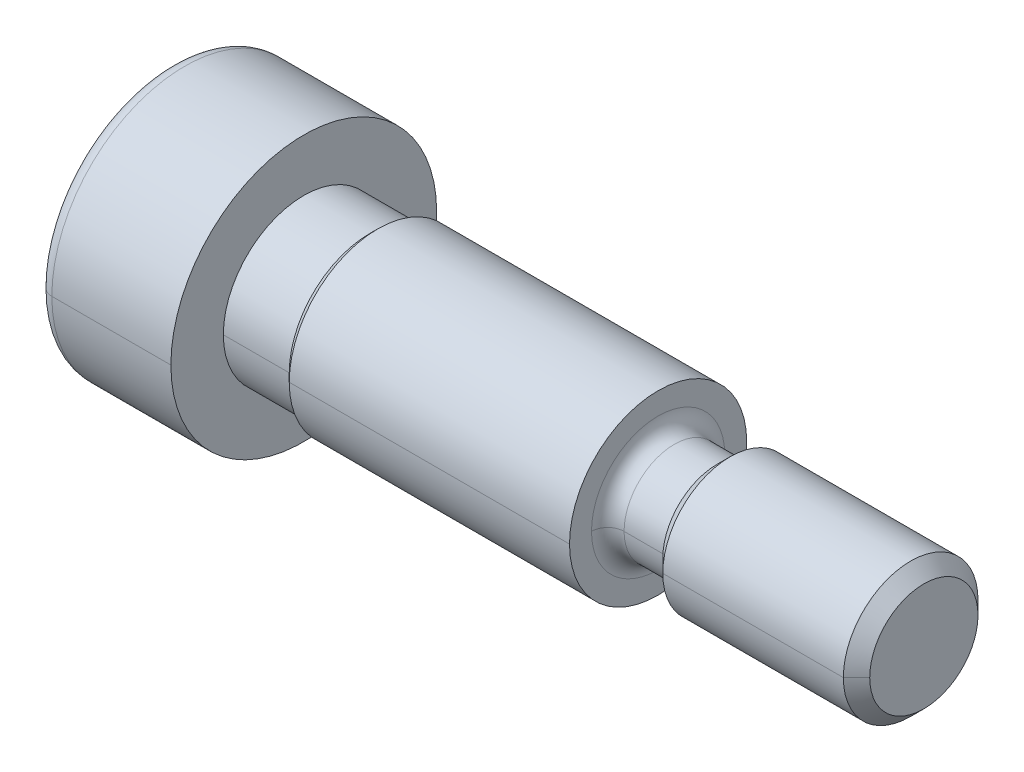
ISO-10303-21;
HEADER;
FILE_DESCRIPTION(('STEP AP214'),'2;1');
FILE_NAME('part.step','',(''),(''),'','','');
FILE_SCHEMA(('AUTOMOTIVE_DESIGN { 1 0 10303 214 1 1 1 1 }'));
ENDSEC;
DATA;
#1=APPLICATION_CONTEXT('core data for automotive mechanical design processes');
#2=APPLICATION_PROTOCOL_DEFINITION('international standard','automotive_design',2000,#1);
#3=PRODUCT_CONTEXT('',#1,'mechanical');
#4=PRODUCT('Part','Part','',(#3));
#5=PRODUCT_RELATED_PRODUCT_CATEGORY('part','',(#4));
#6=PRODUCT_DEFINITION_FORMATION('','',#4);
#7=PRODUCT_DEFINITION_CONTEXT('part definition',#1,'design');
#8=PRODUCT_DEFINITION('design','',#6,#7);
#9=PRODUCT_DEFINITION_SHAPE('','',#8);
#10=(LENGTH_UNIT() NAMED_UNIT(*) SI_UNIT(.MILLI.,.METRE.));
#11=(NAMED_UNIT(*) PLANE_ANGLE_UNIT() SI_UNIT($,.RADIAN.));
#12=(NAMED_UNIT(*) SI_UNIT($,.STERADIAN.) SOLID_ANGLE_UNIT());
#13=UNCERTAINTY_MEASURE_WITH_UNIT(LENGTH_MEASURE(1.E-05),#10,'distance_accuracy_value','');
#14=(GEOMETRIC_REPRESENTATION_CONTEXT(3) GLOBAL_UNCERTAINTY_ASSIGNED_CONTEXT((#13)) GLOBAL_UNIT_ASSIGNED_CONTEXT((#10,
#11,#12)) REPRESENTATION_CONTEXT('',''));
#15=CARTESIAN_POINT('',(0.,0.,0.));
#16=DIRECTION('',(0.,0.,1.));
#17=DIRECTION('',(1.,0.,0.));
#18=AXIS2_PLACEMENT_3D('',#15,#16,#17);
#19=CARTESIAN_POINT('',(-4.26719999746,0.,0.));
#20=DIRECTION('',(-1.,0.,0.));
#21=DIRECTION('',(0.,0.,1.));
#22=AXIS2_PLACEMENT_3D('',#19,#20,#21);
#23=TOROIDAL_SURFACE('',#22,4.25449999746,0.508);
#24=CARTESIAN_POINT('',(-4.26719999746,0.,4.25449999746));
#25=DIRECTION('',(0.,-1.,0.));
#26=DIRECTION('',(0.,0.,1.));
#27=AXIS2_PLACEMENT_3D('',#24,#25,#26);
#28=CIRCLE('',#27,0.508);
#29=CARTESIAN_POINT('',(-4.2672,0.,4.7625));
#30=VERTEX_POINT('',#29);
#31=CARTESIAN_POINT('',(-4.77519999746,0.,4.2545));
#32=VERTEX_POINT('',#31);
#33=EDGE_CURVE('E27',#30,#32,#28,.T.);
#34=ORIENTED_EDGE('',*,*,#33,.F.);
#35=CARTESIAN_POINT('',(-4.2672,0.,0.));
#36=DIRECTION('',(-1.,0.,0.));
#37=DIRECTION('',(0.,0.,1.));
#38=AXIS2_PLACEMENT_3D('',#35,#36,#37);
#39=CIRCLE('',#38,4.7625);
#40=CARTESIAN_POINT('',(-4.2672,0.,-4.7625));
#41=VERTEX_POINT('',#40);
#42=EDGE_CURVE('E189',#30,#41,#39,.T.);
#43=ORIENTED_EDGE('',*,*,#42,.T.);
#44=CARTESIAN_POINT('',(-4.26719999746,0.,-4.25449999746));
#45=DIRECTION('',(0.,-1.,0.));
#46=DIRECTION('',(0.,0.,-1.));
#47=AXIS2_PLACEMENT_3D('',#44,#45,#46);
#48=CIRCLE('',#47,0.508);
#49=CARTESIAN_POINT('',(-4.77519999746,0.,-4.2545));
#50=VERTEX_POINT('',#49);
#51=EDGE_CURVE('E10',#50,#41,#48,.T.);
#52=ORIENTED_EDGE('',*,*,#51,.F.);
#53=CARTESIAN_POINT('',(-4.77519999746,0.,0.));
#54=DIRECTION('',(-1.,0.,0.));
#55=DIRECTION('',(0.,0.,1.));
#56=AXIS2_PLACEMENT_3D('',#53,#54,#55);
#57=CIRCLE('',#56,4.2545);
#58=EDGE_CURVE('E283',#32,#50,#57,.T.);
#59=ORIENTED_EDGE('',*,*,#58,.F.);
#60=EDGE_LOOP('',(#34,#43,#52,#59));
#61=FACE_BOUND('',#60,.T.);
#62=ADVANCED_FACE('F16',(#61),#23,.T.);
#63=CARTESIAN_POINT('',(-4.26719999746,0.,0.));
#64=DIRECTION('',(-1.,0.,0.));
#65=DIRECTION('',(0.,0.,1.));
#66=AXIS2_PLACEMENT_3D('',#63,#64,#65);
#67=TOROIDAL_SURFACE('',#66,4.25449999746,0.508);
#68=ORIENTED_EDGE('',*,*,#33,.T.);
#69=CARTESIAN_POINT('',(-4.77519999746,0.,0.));
#70=DIRECTION('',(-1.,0.,0.));
#71=DIRECTION('',(0.,0.,1.));
#72=AXIS2_PLACEMENT_3D('',#69,#70,#71);
#73=CIRCLE('',#72,4.2545);
#74=EDGE_CURVE('E287',#50,#32,#73,.T.);
#75=ORIENTED_EDGE('',*,*,#74,.F.);
#76=ORIENTED_EDGE('',*,*,#51,.T.);
#77=CARTESIAN_POINT('',(-4.2672,0.,0.));
#78=DIRECTION('',(-1.,0.,0.));
#79=DIRECTION('',(0.,0.,1.));
#80=AXIS2_PLACEMENT_3D('',#77,#78,#79);
#81=CIRCLE('',#80,4.7625);
#82=EDGE_CURVE('E194',#41,#30,#81,.T.);
#83=ORIENTED_EDGE('',*,*,#82,.T.);
#84=EDGE_LOOP('',(#68,#75,#76,#83));
#85=FACE_BOUND('',#84,.T.);
#86=ADVANCED_FACE('F408',(#85),#67,.T.);
#87=CARTESIAN_POINT('',(-2.1336,0.,0.));
#88=DIRECTION('',(-1.,0.,0.));
#89=DIRECTION('',(0.,0.,1.));
#90=AXIS2_PLACEMENT_3D('',#87,#88,#89);
#91=CYLINDRICAL_SURFACE('',#90,4.7625);
#92=DIRECTION('',(-1.,0.,0.));
#93=VECTOR('',#92,1.);
#94=CARTESIAN_POINT('',(-2.1336,0.,4.7625));
#95=LINE('',#94,#93);
#96=CARTESIAN_POINT('',(0.,0.,4.7625));
#97=VERTEX_POINT('',#96);
#98=EDGE_CURVE('E184',#97,#30,#95,.T.);
#99=ORIENTED_EDGE('',*,*,#98,.F.);
#100=CARTESIAN_POINT('',(0.,0.,0.));
#101=DIRECTION('',(-1.,0.,0.));
#102=DIRECTION('',(0.,0.,1.));
#103=AXIS2_PLACEMENT_3D('',#100,#101,#102);
#104=CIRCLE('',#103,4.7625);
#105=CARTESIAN_POINT('',(0.,0.,-4.7625));
#106=VERTEX_POINT('',#105);
#107=EDGE_CURVE('E188',#97,#106,#104,.T.);
#108=ORIENTED_EDGE('',*,*,#107,.T.);
#109=DIRECTION('',(1.,0.,0.));
#110=VECTOR('',#109,1.);
#111=CARTESIAN_POINT('',(-2.1336,0.,-4.7625));
#112=LINE('',#111,#110);
#113=EDGE_CURVE('E20',#41,#106,#112,.T.);
#114=ORIENTED_EDGE('',*,*,#113,.F.);
#115=ORIENTED_EDGE('',*,*,#42,.F.);
#116=EDGE_LOOP('',(#99,#108,#114,#115));
#117=FACE_BOUND('',#116,.T.);
#118=ADVANCED_FACE('F18',(#117),#91,.T.);
#119=CARTESIAN_POINT('',(-4.77519999873,0.,2.12725));
#120=DIRECTION('',(-1.,0.,0.));
#121=DIRECTION('',(0.,0.,1.));
#122=AXIS2_PLACEMENT_3D('',#119,#120,#121);
#123=PLANE('',#122);
#124=ORIENTED_EDGE('',*,*,#58,.T.);
#125=ORIENTED_EDGE('',*,*,#74,.T.);
#126=EDGE_LOOP('',(#124,#125));
#127=FACE_BOUND('',#126,.T.);
#128=DIRECTION('',(0.,0.,-1.));
#129=VECTOR('',#128,1.);
#130=CARTESIAN_POINT('',(-4.7752,1.5875,-0.916543552338532));
#131=LINE('',#130,#129);
#132=CARTESIAN_POINT('',(-4.7752,1.5875,0.916543552338529));
#133=VERTEX_POINT('',#132);
#134=CARTESIAN_POINT('',(-4.7752,1.5875,-0.916543552338532));
#135=VERTEX_POINT('',#134);
#136=EDGE_CURVE('E205',#133,#135,#131,.T.);
#137=ORIENTED_EDGE('',*,*,#136,.F.);
#138=DIRECTION('',(0.,0.866025403784439,-0.5));
#139=VECTOR('',#138,1.);
#140=CARTESIAN_POINT('',(-4.7752,1.5875,0.916543552338531));
#141=LINE('',#140,#139);
#142=CARTESIAN_POINT('',(-4.7752,0.,1.83308710467706));
#143=VERTEX_POINT('',#142);
#144=EDGE_CURVE('E276',#143,#133,#141,.T.);
#145=ORIENTED_EDGE('',*,*,#144,.F.);
#146=DIRECTION('',(0.,0.866025403784439,0.5));
#147=VECTOR('',#146,1.);
#148=CARTESIAN_POINT('',(-4.7752,0.,1.83308710467706));
#149=LINE('',#148,#147);
#150=CARTESIAN_POINT('',(-4.7752,-1.5875,0.916543552338531));
#151=VERTEX_POINT('',#150);
#152=EDGE_CURVE('E277',#151,#143,#149,.T.);
#153=ORIENTED_EDGE('',*,*,#152,.F.);
#154=DIRECTION('',(0.,0.,1.));
#155=VECTOR('',#154,1.);
#156=CARTESIAN_POINT('',(-4.7752,-1.5875,0.916543552338531));
#157=LINE('',#156,#155);
#158=CARTESIAN_POINT('',(-4.7752,-1.5875,-0.91654355233853));
#159=VERTEX_POINT('',#158);
#160=EDGE_CURVE('E223',#159,#151,#157,.T.);
#161=ORIENTED_EDGE('',*,*,#160,.F.);
#162=DIRECTION('',(0.,-0.866025403784439,0.5));
#163=VECTOR('',#162,1.);
#164=CARTESIAN_POINT('',(-4.7752,-1.5875,-0.916543552338532));
#165=LINE('',#164,#163);
#166=CARTESIAN_POINT('',(-4.7752,0.,-1.83308710467706));
#167=VERTEX_POINT('',#166);
#168=EDGE_CURVE('E232',#167,#159,#165,.T.);
#169=ORIENTED_EDGE('',*,*,#168,.F.);
#170=DIRECTION('',(0.,-0.866025403784438,-0.5));
#171=VECTOR('',#170,1.);
#172=CARTESIAN_POINT('',(-4.7752,0.,-1.83308710467706));
#173=LINE('',#172,#171);
#174=EDGE_CURVE('E233',#135,#167,#173,.T.);
#175=ORIENTED_EDGE('',*,*,#174,.F.);
#176=EDGE_LOOP('',(#137,#145,#153,#161,#169,#175));
#177=FACE_BOUND('',#176,.T.);
#178=ADVANCED_FACE('F417',(#127,#177),#123,.T.);
#179=CARTESIAN_POINT('',(-2.1336,0.,0.));
#180=DIRECTION('',(-1.,0.,0.));
#181=DIRECTION('',(0.,0.,1.));
#182=AXIS2_PLACEMENT_3D('',#179,#180,#181);
#183=CYLINDRICAL_SURFACE('',#182,4.7625);
#184=ORIENTED_EDGE('',*,*,#98,.T.);
#185=ORIENTED_EDGE('',*,*,#82,.F.);
#186=ORIENTED_EDGE('',*,*,#113,.T.);
#187=CARTESIAN_POINT('',(0.,0.,0.));
#188=DIRECTION('',(-1.,0.,0.));
#189=DIRECTION('',(0.,0.,1.));
#190=AXIS2_PLACEMENT_3D('',#187,#188,#189);
#191=CIRCLE('',#190,4.7625);
#192=EDGE_CURVE('E195',#106,#97,#191,.T.);
#193=ORIENTED_EDGE('',*,*,#192,.T.);
#194=EDGE_LOOP('',(#184,#185,#186,#193));
#195=FACE_BOUND('',#194,.T.);
#196=ADVANCED_FACE('F198',(#195),#183,.T.);
#197=CARTESIAN_POINT('',(0.,0.,2.38125));
#198=DIRECTION('',(1.,0.,0.));
#199=DIRECTION('',(0.,0.,1.));
#200=AXIS2_PLACEMENT_3D('',#197,#198,#199);
#201=PLANE('',#200);
#202=ORIENTED_EDGE('',*,*,#107,.F.);
#203=ORIENTED_EDGE('',*,*,#192,.F.);
#204=EDGE_LOOP('',(#202,#203));
#205=FACE_BOUND('',#204,.T.);
#206=CARTESIAN_POINT('',(0.,0.,0.));
#207=DIRECTION('',(-1.,0.,0.));
#208=DIRECTION('',(0.,0.,-1.));
#209=AXIS2_PLACEMENT_3D('',#206,#207,#208);
#210=CIRCLE('',#209,2.8829);
#211=CARTESIAN_POINT('',(0.,0.,-2.8829));
#212=VERTEX_POINT('',#211);
#213=CARTESIAN_POINT('',(0.,0.,2.8829));
#214=VERTEX_POINT('',#213);
#215=EDGE_CURVE('E326',#212,#214,#210,.T.);
#216=ORIENTED_EDGE('',*,*,#215,.T.);
#217=CARTESIAN_POINT('',(0.,0.,0.));
#218=DIRECTION('',(-1.,0.,0.));
#219=DIRECTION('',(0.,0.,-1.));
#220=AXIS2_PLACEMENT_3D('',#217,#218,#219);
#221=CIRCLE('',#220,2.8829);
#222=EDGE_CURVE('E238',#214,#212,#221,.T.);
#223=ORIENTED_EDGE('',*,*,#222,.T.);
#224=EDGE_LOOP('',(#216,#223));
#225=FACE_BOUND('',#224,.T.);
#226=ADVANCED_FACE('F202',(#205,#225),#201,.T.);
#227=CARTESIAN_POINT('',(0.,1.5875,0.91654355233853));
#228=DIRECTION('',(0.,-1.,0.));
#229=DIRECTION('',(-1.,0.,0.));
#230=AXIS2_PLACEMENT_3D('',#227,#228,#229);
#231=PLANE('',#230);
#232=DIRECTION('',(0.,0.,-1.));
#233=VECTOR('',#232,1.);
#234=CARTESIAN_POINT('',(-2.3876,1.5875,0.458271776169265));
#235=LINE('',#234,#233);
#236=CARTESIAN_POINT('',(-2.3876,1.5875,0.91654355233853));
#237=VERTEX_POINT('',#236);
#238=CARTESIAN_POINT('',(-2.3876,1.5875,-0.916543552338532));
#239=VERTEX_POINT('',#238);
#240=EDGE_CURVE('E239',#237,#239,#235,.T.);
#241=ORIENTED_EDGE('',*,*,#240,.F.);
#242=DIRECTION('',(1.,0.,0.));
#243=VECTOR('',#242,1.);
#244=CARTESIAN_POINT('',(-3.5814,1.5875,0.91654355233853));
#245=LINE('',#244,#243);
#246=EDGE_CURVE('E211',#133,#237,#245,.T.);
#247=ORIENTED_EDGE('',*,*,#246,.F.);
#248=ORIENTED_EDGE('',*,*,#136,.T.);
#249=DIRECTION('',(-1.,0.,0.));
#250=VECTOR('',#249,1.);
#251=CARTESIAN_POINT('',(-3.5814,1.5875,-0.91654355233853));
#252=LINE('',#251,#250);
#253=EDGE_CURVE('E322',#239,#135,#252,.T.);
#254=ORIENTED_EDGE('',*,*,#253,.F.);
#255=EDGE_LOOP('',(#241,#247,#248,#254));
#256=FACE_BOUND('',#255,.T.);
#257=ADVANCED_FACE('F512',(#256),#231,.T.);
#258=CARTESIAN_POINT('',(0.,0.,1.83308710467706));
#259=DIRECTION('',(0.,-0.5,-0.866025403784439));
#260=DIRECTION('',(0.,-0.866025403784439,0.5));
#261=AXIS2_PLACEMENT_3D('',#258,#259,#260);
#262=PLANE('',#261);
#263=DIRECTION('',(0.,0.866025403784439,-0.5));
#264=VECTOR('',#263,1.);
#265=CARTESIAN_POINT('',(-2.3876,0.396875,1.60395121659243));
#266=LINE('',#265,#264);
#267=CARTESIAN_POINT('',(-2.3876,0.,1.83308710467706));
#268=VERTEX_POINT('',#267);
#269=EDGE_CURVE('E221',#268,#237,#266,.T.);
#270=ORIENTED_EDGE('',*,*,#269,.F.);
#271=DIRECTION('',(1.,0.,0.));
#272=VECTOR('',#271,1.);
#273=CARTESIAN_POINT('',(-3.5814,0.,1.83308710467706));
#274=LINE('',#273,#272);
#275=EDGE_CURVE('E273',#143,#268,#274,.T.);
#276=ORIENTED_EDGE('',*,*,#275,.F.);
#277=ORIENTED_EDGE('',*,*,#144,.T.);
#278=ORIENTED_EDGE('',*,*,#246,.T.);
#279=EDGE_LOOP('',(#270,#276,#277,#278));
#280=FACE_BOUND('',#279,.T.);
#281=ADVANCED_FACE('F509',(#280),#262,.T.);
#282=CARTESIAN_POINT('',(0.,-1.5875,0.91654355233853));
#283=DIRECTION('',(0.,0.5,-0.866025403784439));
#284=DIRECTION('',(-1.,0.,0.));
#285=AXIS2_PLACEMENT_3D('',#282,#283,#284);
#286=PLANE('',#285);
#287=DIRECTION('',(0.,0.866025403784439,0.5));
#288=VECTOR('',#287,1.);
#289=CARTESIAN_POINT('',(-2.3876,-1.190625,1.14567944042316));
#290=LINE('',#289,#288);
#291=CARTESIAN_POINT('',(-2.3876,-1.5875,0.916543552338531));
#292=VERTEX_POINT('',#291);
#293=EDGE_CURVE('E217',#292,#268,#290,.T.);
#294=ORIENTED_EDGE('',*,*,#293,.F.);
#295=DIRECTION('',(1.,0.,0.));
#296=VECTOR('',#295,1.);
#297=CARTESIAN_POINT('',(-3.5814,-1.5875,0.91654355233853));
#298=LINE('',#297,#296);
#299=EDGE_CURVE('E227',#151,#292,#298,.T.);
#300=ORIENTED_EDGE('',*,*,#299,.F.);
#301=ORIENTED_EDGE('',*,*,#152,.T.);
#302=ORIENTED_EDGE('',*,*,#275,.T.);
#303=EDGE_LOOP('',(#294,#300,#301,#302));
#304=FACE_BOUND('',#303,.T.);
#305=ADVANCED_FACE('F422',(#304),#286,.T.);
#306=CARTESIAN_POINT('',(0.,-1.5875,-0.916543552338531));
#307=DIRECTION('',(0.,1.,0.));
#308=DIRECTION('',(0.,0.,-1.));
#309=AXIS2_PLACEMENT_3D('',#306,#307,#308);
#310=PLANE('',#309);
#311=DIRECTION('',(0.,0.,1.));
#312=VECTOR('',#311,1.);
#313=CARTESIAN_POINT('',(-2.3876,-1.5875,-0.458271776169266));
#314=LINE('',#313,#312);
#315=CARTESIAN_POINT('',(-2.3876,-1.5875,-0.916543552338531));
#316=VERTEX_POINT('',#315);
#317=EDGE_CURVE('E222',#316,#292,#314,.T.);
#318=ORIENTED_EDGE('',*,*,#317,.F.);
#319=DIRECTION('',(1.,0.,0.));
#320=VECTOR('',#319,1.);
#321=CARTESIAN_POINT('',(-3.5814,-1.5875,-0.916543552338531));
#322=LINE('',#321,#320);
#323=EDGE_CURVE('E228',#159,#316,#322,.T.);
#324=ORIENTED_EDGE('',*,*,#323,.F.);
#325=ORIENTED_EDGE('',*,*,#160,.T.);
#326=ORIENTED_EDGE('',*,*,#299,.T.);
#327=EDGE_LOOP('',(#318,#324,#325,#326));
#328=FACE_BOUND('',#327,.T.);
#329=ADVANCED_FACE('F419',(#328),#310,.T.);
#330=CARTESIAN_POINT('',(0.,0.,-1.83308710467706));
#331=DIRECTION('',(0.,0.5,0.866025403784439));
#332=DIRECTION('',(1.,0.,0.));
#333=AXIS2_PLACEMENT_3D('',#330,#331,#332);
#334=PLANE('',#333);
#335=DIRECTION('',(0.,-0.866025403784439,0.5));
#336=VECTOR('',#335,1.);
#337=CARTESIAN_POINT('',(-2.3876,-0.396875,-1.60395121659243));
#338=LINE('',#337,#336);
#339=CARTESIAN_POINT('',(-2.3876,0.,-1.83308710467706));
#340=VERTEX_POINT('',#339);
#341=EDGE_CURVE('E314',#340,#316,#338,.T.);
#342=ORIENTED_EDGE('',*,*,#341,.F.);
#343=DIRECTION('',(1.,0.,0.));
#344=VECTOR('',#343,1.);
#345=CARTESIAN_POINT('',(-3.5814,0.,-1.83308710467706));
#346=LINE('',#345,#344);
#347=EDGE_CURVE('E229',#167,#340,#346,.T.);
#348=ORIENTED_EDGE('',*,*,#347,.F.);
#349=ORIENTED_EDGE('',*,*,#168,.T.);
#350=ORIENTED_EDGE('',*,*,#323,.T.);
#351=EDGE_LOOP('',(#342,#348,#349,#350));
#352=FACE_BOUND('',#351,.T.);
#353=ADVANCED_FACE('F421',(#352),#334,.T.);
#354=CARTESIAN_POINT('',(0.,1.5875,-0.916543552338529));
#355=DIRECTION('',(0.,-0.5,0.866025403784438));
#356=DIRECTION('',(-1.,0.,0.));
#357=AXIS2_PLACEMENT_3D('',#354,#355,#356);
#358=PLANE('',#357);
#359=DIRECTION('',(0.,-0.866025403784438,-0.5));
#360=VECTOR('',#359,1.);
#361=CARTESIAN_POINT('',(-2.3876,1.190625,-1.14567944042316));
#362=LINE('',#361,#360);
#363=EDGE_CURVE('E318',#239,#340,#362,.T.);
#364=ORIENTED_EDGE('',*,*,#363,.F.);
#365=ORIENTED_EDGE('',*,*,#253,.T.);
#366=ORIENTED_EDGE('',*,*,#174,.T.);
#367=ORIENTED_EDGE('',*,*,#347,.T.);
#368=EDGE_LOOP('',(#364,#365,#366,#367));
#369=FACE_BOUND('',#368,.T.);
#370=ADVANCED_FACE('F579',(#369),#358,.T.);
#371=CARTESIAN_POINT('',(1.1811,0.,0.));
#372=DIRECTION('',(-1.,0.,0.));
#373=DIRECTION('',(0.,0.,-1.));
#374=AXIS2_PLACEMENT_3D('',#371,#372,#373);
#375=CYLINDRICAL_SURFACE('',#374,2.8829);
#376=DIRECTION('',(-1.,0.,0.));
#377=VECTOR('',#376,1.);
#378=CARTESIAN_POINT('',(1.1811,0.,-2.8829));
#379=LINE('',#378,#377);
#380=CARTESIAN_POINT('',(2.3622,0.,-2.8829));
#381=VERTEX_POINT('',#380);
#382=EDGE_CURVE('E234',#381,#212,#379,.T.);
#383=ORIENTED_EDGE('',*,*,#382,.F.);
#384=CARTESIAN_POINT('',(2.3622,0.,0.));
#385=DIRECTION('',(1.,0.,0.));
#386=DIRECTION('',(0.,0.,-1.));
#387=AXIS2_PLACEMENT_3D('',#384,#385,#386);
#388=CIRCLE('',#387,2.8829);
#389=CARTESIAN_POINT('',(2.3622,0.,2.8829));
#390=VERTEX_POINT('',#389);
#391=EDGE_CURVE('E215',#390,#381,#388,.T.);
#392=ORIENTED_EDGE('',*,*,#391,.F.);
#393=DIRECTION('',(1.,0.,0.));
#394=VECTOR('',#393,1.);
#395=CARTESIAN_POINT('',(1.1811,0.,2.8829));
#396=LINE('',#395,#394);
#397=EDGE_CURVE('E291',#214,#390,#396,.T.);
#398=ORIENTED_EDGE('',*,*,#397,.F.);
#399=ORIENTED_EDGE('',*,*,#215,.F.);
#400=EDGE_LOOP('',(#383,#392,#398,#399));
#401=FACE_BOUND('',#400,.T.);
#402=ADVANCED_FACE('F428',(#401),#375,.T.);
#403=CARTESIAN_POINT('',(1.1811,0.,0.));
#404=DIRECTION('',(-1.,0.,0.));
#405=DIRECTION('',(0.,0.,-1.));
#406=AXIS2_PLACEMENT_3D('',#403,#404,#405);
#407=CYLINDRICAL_SURFACE('',#406,2.8829);
#408=ORIENTED_EDGE('',*,*,#382,.T.);
#409=ORIENTED_EDGE('',*,*,#222,.F.);
#410=ORIENTED_EDGE('',*,*,#397,.T.);
#411=CARTESIAN_POINT('',(2.3622,0.,0.));
#412=DIRECTION('',(1.,0.,0.));
#413=DIRECTION('',(0.,0.,-1.));
#414=AXIS2_PLACEMENT_3D('',#411,#412,#413);
#415=CIRCLE('',#414,2.8829);
#416=EDGE_CURVE('E259',#381,#390,#415,.T.);
#417=ORIENTED_EDGE('',*,*,#416,.F.);
#418=EDGE_LOOP('',(#408,#409,#410,#417));
#419=FACE_BOUND('',#418,.T.);
#420=ADVANCED_FACE('F425',(#419),#407,.T.);
#421=CARTESIAN_POINT('',(-2.3876,0.,0.));
#422=DIRECTION('',(1.,0.,0.));
#423=DIRECTION('',(0.,0.,1.));
#424=AXIS2_PLACEMENT_3D('',#421,#422,#423);
#425=PLANE('',#424);
#426=ORIENTED_EDGE('',*,*,#363,.T.);
#427=ORIENTED_EDGE('',*,*,#341,.T.);
#428=ORIENTED_EDGE('',*,*,#317,.T.);
#429=ORIENTED_EDGE('',*,*,#293,.T.);
#430=ORIENTED_EDGE('',*,*,#269,.T.);
#431=ORIENTED_EDGE('',*,*,#240,.T.);
#432=EDGE_LOOP('',(#426,#427,#428,#429,#430,#431));
#433=FACE_BOUND('',#432,.T.);
#434=ADVANCED_FACE('F427',(#433),#425,.F.);
#435=CARTESIAN_POINT('',(2.50825,0.,0.));
#436=DIRECTION('',(1.,0.,0.));
#437=DIRECTION('',(0.,0.,-1.));
#438=AXIS2_PLACEMENT_3D('',#435,#436,#437);
#439=CONICAL_SURFACE('',#438,3.02895,0.785398163397448);
#440=DIRECTION('',(-0.707106781186548,0.,0.707106781186547));
#441=VECTOR('',#440,1.);
#442=CARTESIAN_POINT('',(2.50825,0.,-3.02895));
#443=LINE('',#442,#441);
#444=CARTESIAN_POINT('',(2.6543,0.,-3.175));
#445=VERTEX_POINT('',#444);
#446=EDGE_CURVE('E265',#445,#381,#443,.T.);
#447=ORIENTED_EDGE('',*,*,#446,.F.);
#448=CARTESIAN_POINT('',(2.6543,0.,0.));
#449=DIRECTION('',(1.,0.,0.));
#450=DIRECTION('',(0.,0.,-1.));
#451=AXIS2_PLACEMENT_3D('',#448,#449,#450);
#452=CIRCLE('',#451,3.175);
#453=CARTESIAN_POINT('',(2.6543,0.,3.175));
#454=VERTEX_POINT('',#453);
#455=EDGE_CURVE('E262',#454,#445,#452,.T.);
#456=ORIENTED_EDGE('',*,*,#455,.F.);
#457=DIRECTION('',(0.707106781186547,0.,0.707106781186548));
#458=VECTOR('',#457,1.);
#459=CARTESIAN_POINT('',(2.50825,0.,3.02895));
#460=LINE('',#459,#458);
#461=EDGE_CURVE('E256',#390,#454,#460,.T.);
#462=ORIENTED_EDGE('',*,*,#461,.F.);
#463=ORIENTED_EDGE('',*,*,#391,.T.);
#464=EDGE_LOOP('',(#447,#456,#462,#463));
#465=FACE_BOUND('',#464,.T.);
#466=ADVANCED_FACE('F563',(#465),#439,.T.);
#467=CARTESIAN_POINT('',(2.50825,0.,0.));
#468=DIRECTION('',(1.,0.,0.));
#469=DIRECTION('',(0.,0.,-1.));
#470=AXIS2_PLACEMENT_3D('',#467,#468,#469);
#471=CONICAL_SURFACE('',#470,3.02895,0.785398163397448);
#472=ORIENTED_EDGE('',*,*,#446,.T.);
#473=ORIENTED_EDGE('',*,*,#416,.T.);
#474=ORIENTED_EDGE('',*,*,#461,.T.);
#475=CARTESIAN_POINT('',(2.6543,0.,0.));
#476=DIRECTION('',(1.,0.,0.));
#477=DIRECTION('',(0.,0.,-1.));
#478=AXIS2_PLACEMENT_3D('',#475,#476,#477);
#479=CIRCLE('',#478,3.175);
#480=EDGE_CURVE('E333',#445,#454,#479,.T.);
#481=ORIENTED_EDGE('',*,*,#480,.F.);
#482=EDGE_LOOP('',(#472,#473,#474,#481));
#483=FACE_BOUND('',#482,.T.);
#484=ADVANCED_FACE('F560',(#483),#471,.T.);
#485=CARTESIAN_POINT('',(7.5311,0.,0.));
#486=DIRECTION('',(1.,0.,0.));
#487=DIRECTION('',(0.,0.,-1.));
#488=AXIS2_PLACEMENT_3D('',#485,#486,#487);
#489=CYLINDRICAL_SURFACE('',#488,3.175);
#490=DIRECTION('',(1.,0.,0.));
#491=VECTOR('',#490,1.);
#492=CARTESIAN_POINT('',(7.5311,0.,-3.175));
#493=LINE('',#492,#491);
#494=CARTESIAN_POINT('',(12.7,0.,-3.175));
#495=VERTEX_POINT('',#494);
#496=EDGE_CURVE('E475',#445,#495,#493,.T.);
#497=ORIENTED_EDGE('',*,*,#496,.T.);
#498=CARTESIAN_POINT('',(12.7,0.,0.));
#499=DIRECTION('',(1.,0.,0.));
#500=DIRECTION('',(0.,0.,-1.));
#501=AXIS2_PLACEMENT_3D('',#498,#499,#500);
#502=CIRCLE('',#501,3.175);
#503=CARTESIAN_POINT('',(12.7,0.,3.175));
#504=VERTEX_POINT('',#503);
#505=EDGE_CURVE('E499',#504,#495,#502,.T.);
#506=ORIENTED_EDGE('',*,*,#505,.F.);
#507=DIRECTION('',(-1.,0.,0.));
#508=VECTOR('',#507,1.);
#509=CARTESIAN_POINT('',(7.5311,0.,3.175));
#510=LINE('',#509,#508);
#511=EDGE_CURVE('E266',#504,#454,#510,.T.);
#512=ORIENTED_EDGE('',*,*,#511,.T.);
#513=ORIENTED_EDGE('',*,*,#455,.T.);
#514=EDGE_LOOP('',(#497,#506,#512,#513));
#515=FACE_BOUND('',#514,.T.);
#516=ADVANCED_FACE('F556',(#515),#489,.T.);
#517=CARTESIAN_POINT('',(7.5311,0.,0.));
#518=DIRECTION('',(1.,0.,0.));
#519=DIRECTION('',(0.,0.,-1.));
#520=AXIS2_PLACEMENT_3D('',#517,#518,#519);
#521=CYLINDRICAL_SURFACE('',#520,3.175);
#522=ORIENTED_EDGE('',*,*,#496,.F.);
#523=ORIENTED_EDGE('',*,*,#480,.T.);
#524=ORIENTED_EDGE('',*,*,#511,.F.);
#525=CARTESIAN_POINT('',(12.7,0.,0.));
#526=DIRECTION('',(1.,0.,0.));
#527=DIRECTION('',(0.,0.,-1.));
#528=AXIS2_PLACEMENT_3D('',#525,#526,#527);
#529=CIRCLE('',#528,3.175);
#530=EDGE_CURVE('E243',#495,#504,#529,.T.);
#531=ORIENTED_EDGE('',*,*,#530,.F.);
#532=EDGE_LOOP('',(#522,#523,#524,#531));
#533=FACE_BOUND('',#532,.T.);
#534=ADVANCED_FACE('F559',(#533),#521,.T.);
#535=CARTESIAN_POINT('',(12.7,0.,-1.5875));
#536=DIRECTION('',(1.,0.,0.));
#537=DIRECTION('',(0.,0.,1.));
#538=AXIS2_PLACEMENT_3D('',#535,#536,#537);
#539=PLANE('',#538);
#540=CARTESIAN_POINT('',(12.7,0.,0.));
#541=DIRECTION('',(1.,0.,0.));
#542=DIRECTION('',(0.,0.,-1.));
#543=AXIS2_PLACEMENT_3D('',#540,#541,#542);
#544=CIRCLE('',#543,2.3876);
#545=CARTESIAN_POINT('',(12.7,0.,2.3876));
#546=VERTEX_POINT('',#545);
#547=CARTESIAN_POINT('',(12.7,0.,-2.3876));
#548=VERTEX_POINT('',#547);
#549=EDGE_CURVE('E240',#546,#548,#544,.T.);
#550=ORIENTED_EDGE('',*,*,#549,.F.);
#551=CARTESIAN_POINT('',(12.7,0.,0.));
#552=DIRECTION('',(1.,0.,0.));
#553=DIRECTION('',(0.,0.,-1.));
#554=AXIS2_PLACEMENT_3D('',#551,#552,#553);
#555=CIRCLE('',#554,2.3876);
#556=EDGE_CURVE('E244',#548,#546,#555,.T.);
#557=ORIENTED_EDGE('',*,*,#556,.F.);
#558=EDGE_LOOP('',(#550,#557));
#559=FACE_BOUND('',#558,.T.);
#560=ORIENTED_EDGE('',*,*,#530,.T.);
#561=ORIENTED_EDGE('',*,*,#505,.T.);
#562=EDGE_LOOP('',(#560,#561));
#563=FACE_BOUND('',#562,.T.);
#564=ADVANCED_FACE('F441',(#559,#563),#539,.T.);
#565=CARTESIAN_POINT('',(13.2842,0.,0.));
#566=DIRECTION('',(1.,0.,0.));
#567=DIRECTION('',(0.,0.,-1.));
#568=AXIS2_PLACEMENT_3D('',#565,#566,#567);
#569=TOROIDAL_SURFACE('',#568,2.3876,0.5842);
#570=CARTESIAN_POINT('',(13.2842,0.,2.3876));
#571=DIRECTION('',(0.,-1.,0.));
#572=DIRECTION('',(0.,0.,1.));
#573=AXIS2_PLACEMENT_3D('',#570,#571,#572);
#574=CIRCLE('',#573,0.5842);
#575=CARTESIAN_POINT('',(13.2842,0.,1.8034));
#576=VERTEX_POINT('',#575);
#577=EDGE_CURVE('E292',#546,#576,#574,.T.);
#578=ORIENTED_EDGE('',*,*,#577,.F.);
#579=ORIENTED_EDGE('',*,*,#549,.T.);
#580=CARTESIAN_POINT('',(13.2842,0.,-2.3876));
#581=DIRECTION('',(0.,-1.,0.));
#582=DIRECTION('',(0.,0.,-1.));
#583=AXIS2_PLACEMENT_3D('',#580,#581,#582);
#584=CIRCLE('',#583,0.5842);
#585=CARTESIAN_POINT('',(13.2842,0.,-1.8034));
#586=VERTEX_POINT('',#585);
#587=EDGE_CURVE('E296',#586,#548,#584,.T.);
#588=ORIENTED_EDGE('',*,*,#587,.F.);
#589=CARTESIAN_POINT('',(13.2842,0.,0.));
#590=DIRECTION('',(-1.,0.,0.));
#591=DIRECTION('',(0.,0.,-1.));
#592=AXIS2_PLACEMENT_3D('',#589,#590,#591);
#593=CIRCLE('',#592,1.8034);
#594=EDGE_CURVE('E297',#586,#576,#593,.T.);
#595=ORIENTED_EDGE('',*,*,#594,.T.);
#596=EDGE_LOOP('',(#578,#579,#588,#595));
#597=FACE_BOUND('',#596,.T.);
#598=ADVANCED_FACE('F433',(#597),#569,.F.);
#599=CARTESIAN_POINT('',(13.2842,0.,0.));
#600=DIRECTION('',(1.,0.,0.));
#601=DIRECTION('',(0.,0.,-1.));
#602=AXIS2_PLACEMENT_3D('',#599,#600,#601);
#603=TOROIDAL_SURFACE('',#602,2.3876,0.5842);
#604=ORIENTED_EDGE('',*,*,#577,.T.);
#605=CARTESIAN_POINT('',(13.2842,0.,0.));
#606=DIRECTION('',(-1.,0.,0.));
#607=DIRECTION('',(0.,0.,-1.));
#608=AXIS2_PLACEMENT_3D('',#605,#606,#607);
#609=CIRCLE('',#608,1.8034);
#610=EDGE_CURVE('E310',#576,#586,#609,.T.);
#611=ORIENTED_EDGE('',*,*,#610,.T.);
#612=ORIENTED_EDGE('',*,*,#587,.T.);
#613=ORIENTED_EDGE('',*,*,#556,.T.);
#614=EDGE_LOOP('',(#604,#611,#612,#613));
#615=FACE_BOUND('',#614,.T.);
#616=ADVANCED_FACE('F430',(#615),#603,.F.);
#617=CARTESIAN_POINT('',(17.4625,0.,0.));
#618=DIRECTION('',(-1.,0.,0.));
#619=DIRECTION('',(0.,0.,-1.));
#620=AXIS2_PLACEMENT_3D('',#617,#618,#619);
#621=CYLINDRICAL_SURFACE('',#620,1.8034);
#622=DIRECTION('',(-1.,0.,0.));
#623=VECTOR('',#622,1.);
#624=CARTESIAN_POINT('',(17.4625,0.,-1.8034));
#625=LINE('',#624,#623);
#626=CARTESIAN_POINT('',(14.8082,0.,-1.8034));
#627=VERTEX_POINT('',#626);
#628=EDGE_CURVE('E341',#627,#586,#625,.T.);
#629=ORIENTED_EDGE('',*,*,#628,.F.);
#630=CARTESIAN_POINT('',(14.8082,0.,0.));
#631=DIRECTION('',(-1.,0.,0.));
#632=DIRECTION('',(0.,0.,-1.));
#633=AXIS2_PLACEMENT_3D('',#630,#631,#632);
#634=CIRCLE('',#633,1.8034);
#635=CARTESIAN_POINT('',(14.8082,0.,1.8034));
#636=VERTEX_POINT('',#635);
#637=EDGE_CURVE('E337',#627,#636,#634,.T.);
#638=ORIENTED_EDGE('',*,*,#637,.T.);
#639=DIRECTION('',(1.,0.,0.));
#640=VECTOR('',#639,1.);
#641=CARTESIAN_POINT('',(17.4625,0.,1.8034));
#642=LINE('',#641,#640);
#643=EDGE_CURVE('E307',#576,#636,#642,.T.);
#644=ORIENTED_EDGE('',*,*,#643,.F.);
#645=ORIENTED_EDGE('',*,*,#594,.F.);
#646=EDGE_LOOP('',(#629,#638,#644,#645));
#647=FACE_BOUND('',#646,.T.);
#648=ADVANCED_FACE('F432',(#647),#621,.T.);
#649=CARTESIAN_POINT('',(17.4625,0.,0.));
#650=DIRECTION('',(-1.,0.,0.));
#651=DIRECTION('',(0.,0.,-1.));
#652=AXIS2_PLACEMENT_3D('',#649,#650,#651);
#653=CYLINDRICAL_SURFACE('',#652,1.8034);
#654=ORIENTED_EDGE('',*,*,#628,.T.);
#655=ORIENTED_EDGE('',*,*,#610,.F.);
#656=ORIENTED_EDGE('',*,*,#643,.T.);
#657=CARTESIAN_POINT('',(14.8082,0.,0.));
#658=DIRECTION('',(-1.,0.,0.));
#659=DIRECTION('',(0.,0.,-1.));
#660=AXIS2_PLACEMENT_3D('',#657,#658,#659);
#661=CIRCLE('',#660,1.8034);
#662=EDGE_CURVE('E306',#636,#627,#661,.T.);
#663=ORIENTED_EDGE('',*,*,#662,.T.);
#664=EDGE_LOOP('',(#654,#655,#656,#663));
#665=FACE_BOUND('',#664,.T.);
#666=ADVANCED_FACE('F438',(#665),#653,.T.);
#667=CARTESIAN_POINT('',(14.8082,0.,-1.2065));
#668=DIRECTION('',(-1.,0.,0.));
#669=DIRECTION('',(0.,0.,1.));
#670=AXIS2_PLACEMENT_3D('',#667,#668,#669);
#671=PLANE('',#670);
#672=ORIENTED_EDGE('',*,*,#662,.F.);
#673=ORIENTED_EDGE('',*,*,#637,.F.);
#674=EDGE_LOOP('',(#672,#673));
#675=FACE_BOUND('',#674,.T.);
#676=CARTESIAN_POINT('',(14.8082,0.,0.));
#677=DIRECTION('',(-1.,0.,0.));
#678=DIRECTION('',(0.,0.,-1.));
#679=AXIS2_PLACEMENT_3D('',#676,#677,#678);
#680=CIRCLE('',#679,1.94056);
#681=CARTESIAN_POINT('',(14.8082,0.,-1.94056));
#682=VERTEX_POINT('',#681);
#683=CARTESIAN_POINT('',(14.8082,0.,1.94056));
#684=VERTEX_POINT('',#683);
#685=EDGE_CURVE('E248',#682,#684,#680,.T.);
#686=ORIENTED_EDGE('',*,*,#685,.T.);
#687=CARTESIAN_POINT('',(14.8082,0.,0.));
#688=DIRECTION('',(-1.,0.,0.));
#689=DIRECTION('',(0.,0.,-1.));
#690=AXIS2_PLACEMENT_3D('',#687,#688,#689);
#691=CIRCLE('',#690,1.94056);
#692=EDGE_CURVE('E249',#684,#682,#691,.T.);
#693=ORIENTED_EDGE('',*,*,#692,.T.);
#694=EDGE_LOOP('',(#686,#693));
#695=FACE_BOUND('',#694,.T.);
#696=ADVANCED_FACE('F544',(#675,#695),#671,.T.);
#697=CARTESIAN_POINT('',(15.04442,0.,0.));
#698=DIRECTION('',(1.,0.,0.));
#699=DIRECTION('',(0.,0.,-1.));
#700=AXIS2_PLACEMENT_3D('',#697,#698,#699);
#701=CONICAL_SURFACE('',#700,2.17678,0.785398163397447);
#702=DIRECTION('',(-0.707106781186548,0.,0.707106781186547));
#703=VECTOR('',#702,1.);
#704=CARTESIAN_POINT('',(15.04442,0.,-2.17678));
#705=LINE('',#704,#703);
#706=CARTESIAN_POINT('',(15.28064,0.,-2.413));
#707=VERTEX_POINT('',#706);
#708=EDGE_CURVE('E272',#707,#682,#705,.T.);
#709=ORIENTED_EDGE('',*,*,#708,.F.);
#710=CARTESIAN_POINT('',(15.28064,0.,0.));
#711=DIRECTION('',(1.,0.,0.));
#712=DIRECTION('',(0.,0.,-1.));
#713=AXIS2_PLACEMENT_3D('',#710,#711,#712);
#714=CIRCLE('',#713,2.413);
#715=CARTESIAN_POINT('',(15.28064,0.,2.413));
#716=VERTEX_POINT('',#715);
#717=EDGE_CURVE('E268',#716,#707,#714,.T.);
#718=ORIENTED_EDGE('',*,*,#717,.F.);
#719=DIRECTION('',(0.707106781186548,0.,0.707106781186547));
#720=VECTOR('',#719,1.);
#721=CARTESIAN_POINT('',(15.04442,0.,2.17678));
#722=LINE('',#721,#720);
#723=EDGE_CURVE('E245',#684,#716,#722,.T.);
#724=ORIENTED_EDGE('',*,*,#723,.F.);
#725=ORIENTED_EDGE('',*,*,#685,.F.);
#726=EDGE_LOOP('',(#709,#718,#724,#725));
#727=FACE_BOUND('',#726,.T.);
#728=ADVANCED_FACE('F538',(#727),#701,.T.);
#729=CARTESIAN_POINT('',(15.04442,0.,0.));
#730=DIRECTION('',(1.,0.,0.));
#731=DIRECTION('',(0.,0.,-1.));
#732=AXIS2_PLACEMENT_3D('',#729,#730,#731);
#733=CONICAL_SURFACE('',#732,2.17678,0.785398163397447);
#734=ORIENTED_EDGE('',*,*,#708,.T.);
#735=ORIENTED_EDGE('',*,*,#692,.F.);
#736=ORIENTED_EDGE('',*,*,#723,.T.);
#737=CARTESIAN_POINT('',(15.28064,0.,0.));
#738=DIRECTION('',(1.,0.,0.));
#739=DIRECTION('',(0.,0.,-1.));
#740=AXIS2_PLACEMENT_3D('',#737,#738,#739);
#741=CIRCLE('',#740,2.413);
#742=EDGE_CURVE('E250',#707,#716,#741,.T.);
#743=ORIENTED_EDGE('',*,*,#742,.F.);
#744=EDGE_LOOP('',(#734,#735,#736,#743));
#745=FACE_BOUND('',#744,.T.);
#746=ADVANCED_FACE('F542',(#745),#733,.T.);
#747=CARTESIAN_POINT('',(18.5166,0.,0.));
#748=DIRECTION('',(-1.,0.,0.));
#749=DIRECTION('',(0.,0.,-1.));
#750=AXIS2_PLACEMENT_3D('',#747,#748,#749);
#751=CYLINDRICAL_SURFACE('',#750,2.413);
#752=DIRECTION('',(-1.,0.,0.));
#753=VECTOR('',#752,1.);
#754=CARTESIAN_POINT('',(18.5166,0.,-2.413));
#755=LINE('',#754,#753);
#756=CARTESIAN_POINT('',(21.75256,0.,-2.413));
#757=VERTEX_POINT('',#756);
#758=EDGE_CURVE('E255',#757,#707,#755,.T.);
#759=ORIENTED_EDGE('',*,*,#758,.F.);
#760=CARTESIAN_POINT('',(21.75256,0.,0.));
#761=DIRECTION('',(-1.,0.,0.));
#762=DIRECTION('',(0.,0.,-1.));
#763=AXIS2_PLACEMENT_3D('',#760,#761,#762);
#764=CIRCLE('',#763,2.413);
#765=CARTESIAN_POINT('',(21.75256,0.,2.413));
#766=VERTEX_POINT('',#765);
#767=EDGE_CURVE('E348',#757,#766,#764,.T.);
#768=ORIENTED_EDGE('',*,*,#767,.T.);
#769=DIRECTION('',(1.,0.,0.));
#770=VECTOR('',#769,1.);
#771=CARTESIAN_POINT('',(18.5166,0.,2.413));
#772=LINE('',#771,#770);
#773=EDGE_CURVE('E254',#716,#766,#772,.T.);
#774=ORIENTED_EDGE('',*,*,#773,.F.);
#775=ORIENTED_EDGE('',*,*,#717,.T.);
#776=EDGE_LOOP('',(#759,#768,#774,#775));
#777=FACE_BOUND('',#776,.T.);
#778=ADVANCED_FACE('F386',(#777),#751,.T.);
#779=CARTESIAN_POINT('',(18.5166,0.,0.));
#780=DIRECTION('',(-1.,0.,0.));
#781=DIRECTION('',(0.,0.,-1.));
#782=AXIS2_PLACEMENT_3D('',#779,#780,#781);
#783=CYLINDRICAL_SURFACE('',#782,2.413);
#784=ORIENTED_EDGE('',*,*,#758,.T.);
#785=ORIENTED_EDGE('',*,*,#742,.T.);
#786=ORIENTED_EDGE('',*,*,#773,.T.);
#787=CARTESIAN_POINT('',(21.75256,0.,0.));
#788=DIRECTION('',(-1.,0.,0.));
#789=DIRECTION('',(0.,0.,-1.));
#790=AXIS2_PLACEMENT_3D('',#787,#788,#789);
#791=CIRCLE('',#790,2.413);
#792=EDGE_CURVE('E345',#766,#757,#791,.T.);
#793=ORIENTED_EDGE('',*,*,#792,.T.);
#794=EDGE_LOOP('',(#784,#785,#786,#793));
#795=FACE_BOUND('',#794,.T.);
#796=ADVANCED_FACE('F380',(#795),#783,.T.);
#797=CARTESIAN_POINT('',(21.98878,0.,0.));
#798=DIRECTION('',(-1.,0.,0.));
#799=DIRECTION('',(0.,0.,1.));
#800=AXIS2_PLACEMENT_3D('',#797,#798,#799);
#801=CONICAL_SURFACE('',#800,2.17678,0.78539816339745);
#802=DIRECTION('',(0.707106781186546,0.,-0.707106781186549));
#803=VECTOR('',#802,1.);
#804=CARTESIAN_POINT('',(21.98878,0.,2.17678));
#805=LINE('',#804,#803);
#806=CARTESIAN_POINT('',(22.225,0.,1.94056));
#807=VERTEX_POINT('',#806);
#808=EDGE_CURVE('E300',#766,#807,#805,.T.);
#809=ORIENTED_EDGE('',*,*,#808,.F.);
#810=ORIENTED_EDGE('',*,*,#767,.F.);
#811=DIRECTION('',(-0.707106781186546,0.,-0.707106781186549));
#812=VECTOR('',#811,1.);
#813=CARTESIAN_POINT('',(21.98878,0.,-2.17678));
#814=LINE('',#813,#812);
#815=CARTESIAN_POINT('',(22.225,0.,-1.94056));
#816=VERTEX_POINT('',#815);
#817=EDGE_CURVE('E303',#816,#757,#814,.T.);
#818=ORIENTED_EDGE('',*,*,#817,.F.);
#819=CARTESIAN_POINT('',(22.225,0.,0.));
#820=DIRECTION('',(1.,0.,0.));
#821=DIRECTION('',(0.,0.,1.));
#822=AXIS2_PLACEMENT_3D('',#819,#820,#821);
#823=CIRCLE('',#822,1.94056);
#824=EDGE_CURVE('E278',#807,#816,#823,.T.);
#825=ORIENTED_EDGE('',*,*,#824,.F.);
#826=EDGE_LOOP('',(#809,#810,#818,#825));
#827=FACE_BOUND('',#826,.T.);
#828=ADVANCED_FACE('F395',(#827),#801,.T.);
#829=CARTESIAN_POINT('',(21.98878,0.,0.));
#830=DIRECTION('',(-1.,0.,0.));
#831=DIRECTION('',(0.,0.,1.));
#832=AXIS2_PLACEMENT_3D('',#829,#830,#831);
#833=CONICAL_SURFACE('',#832,2.17678,0.78539816339745);
#834=ORIENTED_EDGE('',*,*,#808,.T.);
#835=CARTESIAN_POINT('',(22.225,0.,0.));
#836=DIRECTION('',(1.,0.,0.));
#837=DIRECTION('',(0.,0.,1.));
#838=AXIS2_PLACEMENT_3D('',#835,#836,#837);
#839=CIRCLE('',#838,1.94056);
#840=EDGE_CURVE('E282',#816,#807,#839,.T.);
#841=ORIENTED_EDGE('',*,*,#840,.F.);
#842=ORIENTED_EDGE('',*,*,#817,.T.);
#843=ORIENTED_EDGE('',*,*,#792,.F.);
#844=EDGE_LOOP('',(#834,#841,#842,#843));
#845=FACE_BOUND('',#844,.T.);
#846=ADVANCED_FACE('F392',(#845),#833,.T.);
#847=CARTESIAN_POINT('',(22.225,0.,-0.9017));
#848=DIRECTION('',(1.,0.,0.));
#849=DIRECTION('',(0.,0.,1.));
#850=AXIS2_PLACEMENT_3D('',#847,#848,#849);
#851=PLANE('',#850);
#852=ORIENTED_EDGE('',*,*,#824,.T.);
#853=ORIENTED_EDGE('',*,*,#840,.T.);
#854=EDGE_LOOP('',(#852,#853));
#855=FACE_BOUND('',#854,.T.);
#856=ADVANCED_FACE('F397',(#855),#851,.T.);
#857=CLOSED_SHELL('',(#62,#86,#118,#178,#196,#226,#257,#281,#305,#329,#353,#370,#402,#420,#434,
#466,#484,#516,#534,#564,#598,#616,#648,#666,#696,#728,#746,#778,#796,#828,#846,#856));
#858=MANIFOLD_SOLID_BREP('B1',#857);
#859=ADVANCED_BREP_SHAPE_REPRESENTATION('',(#18,#858),#14);
#860=SHAPE_DEFINITION_REPRESENTATION(#9,#859);
ENDSEC;
END-ISO-10303-21;
